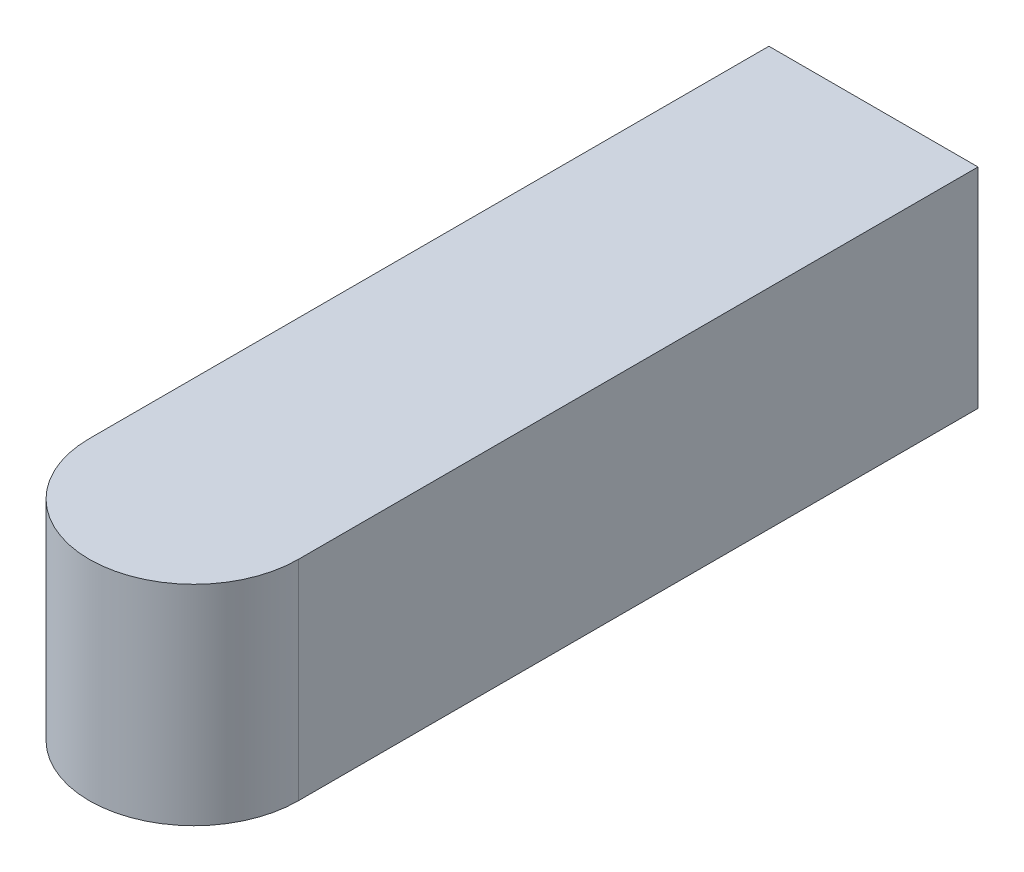
ISO-10303-21;
HEADER;
FILE_DESCRIPTION(('STEP AP214'),'2;1');
FILE_NAME('part.step','',(''),(''),'','','');
FILE_SCHEMA(('AUTOMOTIVE_DESIGN { 1 0 10303 214 1 1 1 1 }'));
ENDSEC;
DATA;
#1=APPLICATION_CONTEXT('core data for automotive mechanical design processes');
#2=APPLICATION_PROTOCOL_DEFINITION('international standard','automotive_design',2000,#1);
#3=PRODUCT_CONTEXT('',#1,'mechanical');
#4=PRODUCT('Part','Part','',(#3));
#5=PRODUCT_RELATED_PRODUCT_CATEGORY('part','',(#4));
#6=PRODUCT_DEFINITION_FORMATION('','',#4);
#7=PRODUCT_DEFINITION_CONTEXT('part definition',#1,'design');
#8=PRODUCT_DEFINITION('design','',#6,#7);
#9=PRODUCT_DEFINITION_SHAPE('','',#8);
#10=(LENGTH_UNIT() NAMED_UNIT(*) SI_UNIT(.MILLI.,.METRE.));
#11=(NAMED_UNIT(*) PLANE_ANGLE_UNIT() SI_UNIT($,.RADIAN.));
#12=(NAMED_UNIT(*) SI_UNIT($,.STERADIAN.) SOLID_ANGLE_UNIT());
#13=UNCERTAINTY_MEASURE_WITH_UNIT(LENGTH_MEASURE(1.E-05),#10,'distance_accuracy_value','');
#14=(GEOMETRIC_REPRESENTATION_CONTEXT(3) GLOBAL_UNCERTAINTY_ASSIGNED_CONTEXT((#13)) GLOBAL_UNIT_ASSIGNED_CONTEXT((#10,
#11,#12)) REPRESENTATION_CONTEXT('',''));
#15=CARTESIAN_POINT('',(0.,0.,0.));
#16=DIRECTION('',(0.,0.,1.));
#17=DIRECTION('',(1.,0.,0.));
#18=AXIS2_PLACEMENT_3D('',#15,#16,#17);
#19=CARTESIAN_POINT('',(0.,4.,26.));
#20=DIRECTION('',(0.,1.,0.));
#21=DIRECTION('',(0.,0.,1.));
#22=AXIS2_PLACEMENT_3D('',#19,#20,#21);
#23=CYLINDRICAL_SURFACE('',#22,4.);
#24=DIRECTION('',(0.,-1.,0.));
#25=VECTOR('',#24,1.);
#26=CARTESIAN_POINT('',(4.,4.,26.));
#27=LINE('',#26,#25);
#28=CARTESIAN_POINT('',(4.,4.,26.));
#29=VERTEX_POINT('',#28);
#30=CARTESIAN_POINT('',(4.,-4.,26.));
#31=VERTEX_POINT('',#30);
#32=EDGE_CURVE('E79',#29,#31,#27,.T.);
#33=ORIENTED_EDGE('',*,*,#32,.F.);
#34=CARTESIAN_POINT('',(0.,4.,26.));
#35=DIRECTION('',(0.,-1.,0.));
#36=DIRECTION('',(1.,0.,0.));
#37=AXIS2_PLACEMENT_3D('',#34,#35,#36);
#38=CIRCLE('',#37,4.);
#39=CARTESIAN_POINT('',(-4.,4.,26.));
#40=VERTEX_POINT('',#39);
#41=EDGE_CURVE('E43',#40,#29,#38,.F.);
#42=ORIENTED_EDGE('',*,*,#41,.F.);
#43=DIRECTION('',(0.,-1.,0.));
#44=VECTOR('',#43,1.);
#45=CARTESIAN_POINT('',(-4.,4.,26.));
#46=LINE('',#45,#44);
#47=CARTESIAN_POINT('',(-4.,-4.,26.));
#48=VERTEX_POINT('',#47);
#49=EDGE_CURVE('E105',#48,#40,#46,.F.);
#50=ORIENTED_EDGE('',*,*,#49,.F.);
#51=CARTESIAN_POINT('',(0.,-4.,26.));
#52=DIRECTION('',(0.,1.,0.));
#53=DIRECTION('',(-1.,0.,0.));
#54=AXIS2_PLACEMENT_3D('',#51,#52,#53);
#55=CIRCLE('',#54,4.);
#56=EDGE_CURVE('E11',#31,#48,#55,.F.);
#57=ORIENTED_EDGE('',*,*,#56,.F.);
#58=EDGE_LOOP('',(#33,#42,#50,#57));
#59=FACE_BOUND('',#58,.T.);
#60=ADVANCED_FACE('F35',(#59),#23,.T.);
#61=CARTESIAN_POINT('',(-4.,-4.,30.));
#62=DIRECTION('',(1.,0.,0.));
#63=DIRECTION('',(0.,0.,-1.));
#64=AXIS2_PLACEMENT_3D('',#61,#62,#63);
#65=PLANE('',#64);
#66=DIRECTION('',(0.,0.,-1.));
#67=VECTOR('',#66,1.);
#68=CARTESIAN_POINT('',(-4.,-4.,30.));
#69=LINE('',#68,#67);
#70=CARTESIAN_POINT('',(-4.,-4.,0.));
#71=VERTEX_POINT('',#70);
#72=EDGE_CURVE('E72',#48,#71,#69,.T.);
#73=ORIENTED_EDGE('',*,*,#72,.F.);
#74=ORIENTED_EDGE('',*,*,#49,.T.);
#75=DIRECTION('',(0.,0.,-1.));
#76=VECTOR('',#75,1.);
#77=CARTESIAN_POINT('',(-4.,4.,30.));
#78=LINE('',#77,#76);
#79=CARTESIAN_POINT('',(-4.,4.,0.));
#80=VERTEX_POINT('',#79);
#81=EDGE_CURVE('E92',#40,#80,#78,.T.);
#82=ORIENTED_EDGE('',*,*,#81,.T.);
#83=DIRECTION('',(0.,-1.,0.));
#84=VECTOR('',#83,1.);
#85=CARTESIAN_POINT('',(-4.,-4.,0.));
#86=LINE('',#85,#84);
#87=EDGE_CURVE('E86',#80,#71,#86,.T.);
#88=ORIENTED_EDGE('',*,*,#87,.T.);
#89=EDGE_LOOP('',(#73,#74,#82,#88));
#90=FACE_BOUND('',#89,.T.);
#91=ADVANCED_FACE('F90',(#90),#65,.F.);
#92=CARTESIAN_POINT('',(4.,-4.,30.));
#93=DIRECTION('',(0.,1.,0.));
#94=DIRECTION('',(-1.,0.,0.));
#95=AXIS2_PLACEMENT_3D('',#92,#93,#94);
#96=PLANE('',#95);
#97=DIRECTION('',(0.,0.,-1.));
#98=VECTOR('',#97,1.);
#99=CARTESIAN_POINT('',(4.,-4.,30.));
#100=LINE('',#99,#98);
#101=CARTESIAN_POINT('',(4.,-4.,0.));
#102=VERTEX_POINT('',#101);
#103=EDGE_CURVE('E80',#31,#102,#100,.T.);
#104=ORIENTED_EDGE('',*,*,#103,.F.);
#105=ORIENTED_EDGE('',*,*,#56,.T.);
#106=ORIENTED_EDGE('',*,*,#72,.T.);
#107=DIRECTION('',(1.,0.,0.));
#108=VECTOR('',#107,1.);
#109=CARTESIAN_POINT('',(4.,-4.,0.));
#110=LINE('',#109,#108);
#111=EDGE_CURVE('E75',#71,#102,#110,.T.);
#112=ORIENTED_EDGE('',*,*,#111,.T.);
#113=EDGE_LOOP('',(#104,#105,#106,#112));
#114=FACE_BOUND('',#113,.T.);
#115=ADVANCED_FACE('F74',(#114),#96,.F.);
#116=CARTESIAN_POINT('',(4.,-4.,30.));
#117=DIRECTION('',(-1.,0.,0.));
#118=DIRECTION('',(0.,0.,1.));
#119=AXIS2_PLACEMENT_3D('',#116,#117,#118);
#120=PLANE('',#119);
#121=DIRECTION('',(0.,0.,-1.));
#122=VECTOR('',#121,1.);
#123=CARTESIAN_POINT('',(4.,4.,30.));
#124=LINE('',#123,#122);
#125=CARTESIAN_POINT('',(4.,4.,0.));
#126=VERTEX_POINT('',#125);
#127=EDGE_CURVE('E100',#29,#126,#124,.T.);
#128=ORIENTED_EDGE('',*,*,#127,.F.);
#129=ORIENTED_EDGE('',*,*,#32,.T.);
#130=ORIENTED_EDGE('',*,*,#103,.T.);
#131=DIRECTION('',(0.,1.,0.));
#132=VECTOR('',#131,1.);
#133=CARTESIAN_POINT('',(4.,-4.,0.));
#134=LINE('',#133,#132);
#135=EDGE_CURVE('E88',#102,#126,#134,.T.);
#136=ORIENTED_EDGE('',*,*,#135,.T.);
#137=EDGE_LOOP('',(#128,#129,#130,#136));
#138=FACE_BOUND('',#137,.T.);
#139=ADVANCED_FACE('F110',(#138),#120,.F.);
#140=CARTESIAN_POINT('',(4.,4.,30.));
#141=DIRECTION('',(0.,-1.,0.));
#142=DIRECTION('',(1.,0.,0.));
#143=AXIS2_PLACEMENT_3D('',#140,#141,#142);
#144=PLANE('',#143);
#145=ORIENTED_EDGE('',*,*,#81,.F.);
#146=ORIENTED_EDGE('',*,*,#41,.T.);
#147=ORIENTED_EDGE('',*,*,#127,.T.);
#148=DIRECTION('',(-1.,0.,0.));
#149=VECTOR('',#148,1.);
#150=CARTESIAN_POINT('',(4.,4.,0.));
#151=LINE('',#150,#149);
#152=EDGE_CURVE('E97',#126,#80,#151,.T.);
#153=ORIENTED_EDGE('',*,*,#152,.T.);
#154=EDGE_LOOP('',(#145,#146,#147,#153));
#155=FACE_BOUND('',#154,.T.);
#156=ADVANCED_FACE('F107',(#155),#144,.F.);
#157=CARTESIAN_POINT('',(0.,0.,0.));
#158=DIRECTION('',(0.,0.,1.));
#159=DIRECTION('',(1.,0.,0.));
#160=AXIS2_PLACEMENT_3D('',#157,#158,#159);
#161=PLANE('',#160);
#162=ORIENTED_EDGE('',*,*,#87,.F.);
#163=ORIENTED_EDGE('',*,*,#152,.F.);
#164=ORIENTED_EDGE('',*,*,#135,.F.);
#165=ORIENTED_EDGE('',*,*,#111,.F.);
#166=EDGE_LOOP('',(#162,#163,#164,#165));
#167=FACE_BOUND('',#166,.T.);
#168=ADVANCED_FACE('F84',(#167),#161,.F.);
#169=CLOSED_SHELL('',(#60,#91,#115,#139,#156,#168));
#170=MANIFOLD_SOLID_BREP('B2',#169);
#171=ADVANCED_BREP_SHAPE_REPRESENTATION('',(#18,#170),#14);
#172=SHAPE_DEFINITION_REPRESENTATION(#9,#171);
ENDSEC;
END-ISO-10303-21;
